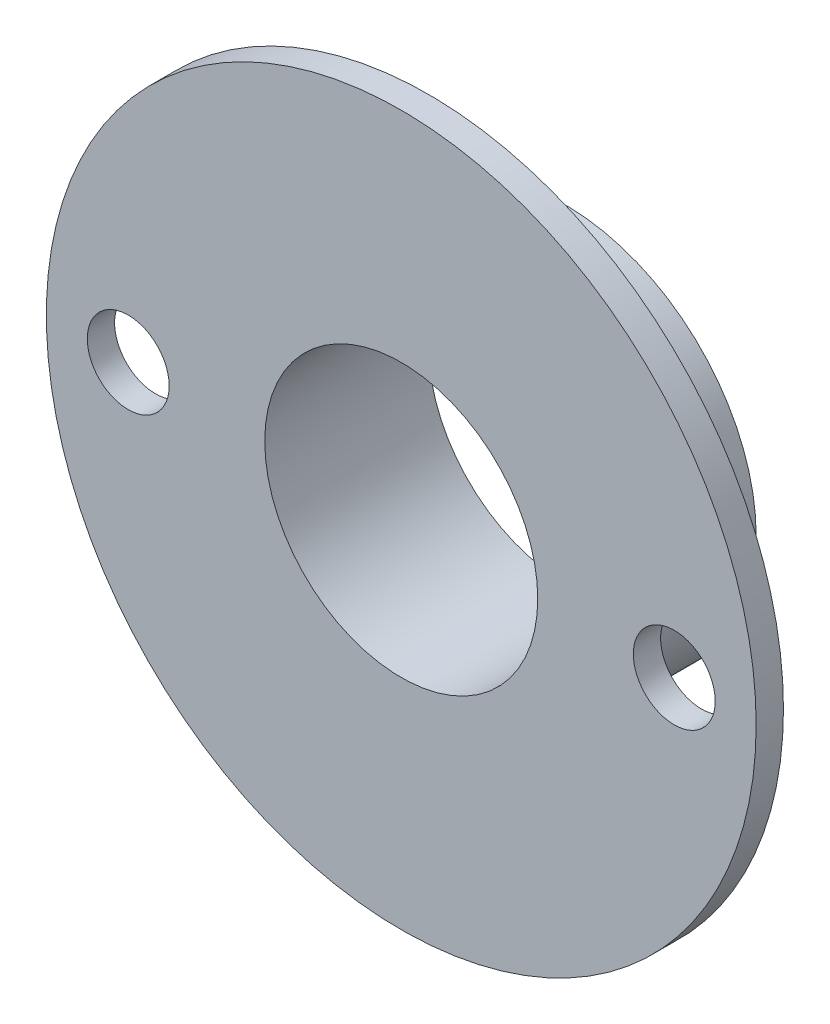
ISO-10303-21;
HEADER;
FILE_DESCRIPTION(('STEP AP214'),'2;1');
FILE_NAME('part.step','',(''),(''),'','','');
FILE_SCHEMA(('AUTOMOTIVE_DESIGN { 1 0 10303 214 1 1 1 1 }'));
ENDSEC;
DATA;
#1=APPLICATION_CONTEXT('core data for automotive mechanical design processes');
#2=APPLICATION_PROTOCOL_DEFINITION('international standard','automotive_design',2000,#1);
#3=PRODUCT_CONTEXT('',#1,'mechanical');
#4=PRODUCT('Part','Part','',(#3));
#5=PRODUCT_RELATED_PRODUCT_CATEGORY('part','',(#4));
#6=PRODUCT_DEFINITION_FORMATION('','',#4);
#7=PRODUCT_DEFINITION_CONTEXT('part definition',#1,'design');
#8=PRODUCT_DEFINITION('design','',#6,#7);
#9=PRODUCT_DEFINITION_SHAPE('','',#8);
#10=(LENGTH_UNIT() NAMED_UNIT(*) SI_UNIT(.MILLI.,.METRE.));
#11=(NAMED_UNIT(*) PLANE_ANGLE_UNIT() SI_UNIT($,.RADIAN.));
#12=(NAMED_UNIT(*) SI_UNIT($,.STERADIAN.) SOLID_ANGLE_UNIT());
#13=UNCERTAINTY_MEASURE_WITH_UNIT(LENGTH_MEASURE(1.E-05),#10,'distance_accuracy_value','');
#14=(GEOMETRIC_REPRESENTATION_CONTEXT(3) GLOBAL_UNCERTAINTY_ASSIGNED_CONTEXT((#13)) GLOBAL_UNIT_ASSIGNED_CONTEXT((#10,
#11,#12)) REPRESENTATION_CONTEXT('',''));
#15=CARTESIAN_POINT('',(0.,0.,0.));
#16=DIRECTION('',(0.,0.,1.));
#17=DIRECTION('',(1.,0.,0.));
#18=AXIS2_PLACEMENT_3D('',#15,#16,#17);
#19=CARTESIAN_POINT('',(0.,0.,6.));
#20=DIRECTION('',(0.,0.,-1.));
#21=DIRECTION('',(-1.,0.,0.));
#22=AXIS2_PLACEMENT_3D('',#19,#20,#21);
#23=CYLINDRICAL_SURFACE('',#22,7.);
#24=CARTESIAN_POINT('',(0.,0.,0.));
#25=DIRECTION('',(0.,0.,1.));
#26=DIRECTION('',(1.,0.,0.));
#27=AXIS2_PLACEMENT_3D('',#24,#25,#26);
#28=CIRCLE('',#27,7.);
#29=CARTESIAN_POINT('',(7.,0.,0.));
#30=VERTEX_POINT('',#29);
#31=EDGE_CURVE('E45',#30,#30,#28,.T.);
#32=ORIENTED_EDGE('',*,*,#31,.T.);
#33=EDGE_LOOP('',(#32));
#34=FACE_BOUND('',#33,.T.);
#35=CARTESIAN_POINT('',(0.,0.,5.));
#36=DIRECTION('',(0.,0.,1.));
#37=DIRECTION('',(1.,0.,0.));
#38=AXIS2_PLACEMENT_3D('',#35,#36,#37);
#39=CIRCLE('',#38,7.);
#40=CARTESIAN_POINT('',(7.,0.,5.));
#41=VERTEX_POINT('',#40);
#42=EDGE_CURVE('E11',#41,#41,#39,.T.);
#43=ORIENTED_EDGE('',*,*,#42,.F.);
#44=EDGE_LOOP('',(#43));
#45=FACE_BOUND('',#44,.T.);
#46=ADVANCED_FACE('F39',(#34,#45),#23,.T.);
#47=CARTESIAN_POINT('',(0.,0.,6.));
#48=DIRECTION('',(0.,0.,1.));
#49=DIRECTION('',(1.,0.,0.));
#50=AXIS2_PLACEMENT_3D('',#47,#48,#49);
#51=PLANE('',#50);
#52=CARTESIAN_POINT('',(-10.,0.,6.));
#53=DIRECTION('',(0.,0.,1.));
#54=DIRECTION('',(1.,0.,0.));
#55=AXIS2_PLACEMENT_3D('',#52,#53,#54);
#56=CIRCLE('',#55,1.5);
#57=CARTESIAN_POINT('',(-8.5,0.,6.));
#58=VERTEX_POINT('',#57);
#59=EDGE_CURVE('E71',#58,#58,#56,.T.);
#60=ORIENTED_EDGE('',*,*,#59,.F.);
#61=EDGE_LOOP('',(#60));
#62=FACE_BOUND('',#61,.T.);
#63=CARTESIAN_POINT('',(10.,0.,6.));
#64=DIRECTION('',(0.,0.,1.));
#65=DIRECTION('',(1.,0.,0.));
#66=AXIS2_PLACEMENT_3D('',#63,#64,#65);
#67=CIRCLE('',#66,1.5);
#68=CARTESIAN_POINT('',(11.5,0.,6.));
#69=VERTEX_POINT('',#68);
#70=EDGE_CURVE('E65',#69,#69,#67,.T.);
#71=ORIENTED_EDGE('',*,*,#70,.F.);
#72=EDGE_LOOP('',(#71));
#73=FACE_BOUND('',#72,.T.);
#74=CARTESIAN_POINT('',(0.,0.,6.));
#75=DIRECTION('',(0.,0.,1.));
#76=DIRECTION('',(1.,0.,0.));
#77=AXIS2_PLACEMENT_3D('',#74,#75,#76);
#78=CIRCLE('',#77,5.);
#79=CARTESIAN_POINT('',(5.,0.,6.));
#80=VERTEX_POINT('',#79);
#81=EDGE_CURVE('E49',#80,#80,#78,.T.);
#82=ORIENTED_EDGE('',*,*,#81,.F.);
#83=EDGE_LOOP('',(#82));
#84=FACE_BOUND('',#83,.T.);
#85=CARTESIAN_POINT('',(0.,0.,6.));
#86=DIRECTION('',(0.,0.,1.));
#87=DIRECTION('',(1.,0.,0.));
#88=AXIS2_PLACEMENT_3D('',#85,#86,#87);
#89=CIRCLE('',#88,13.);
#90=CARTESIAN_POINT('',(13.,0.,6.));
#91=VERTEX_POINT('',#90);
#92=EDGE_CURVE('E59',#91,#91,#89,.T.);
#93=ORIENTED_EDGE('',*,*,#92,.T.);
#94=EDGE_LOOP('',(#93));
#95=FACE_BOUND('',#94,.T.);
#96=ADVANCED_FACE('F87',(#62,#73,#84,#95),#51,.T.);
#97=CARTESIAN_POINT('',(0.,0.,0.));
#98=DIRECTION('',(0.,0.,1.));
#99=DIRECTION('',(1.,0.,0.));
#100=AXIS2_PLACEMENT_3D('',#97,#98,#99);
#101=PLANE('',#100);
#102=ORIENTED_EDGE('',*,*,#31,.F.);
#103=EDGE_LOOP('',(#102));
#104=FACE_BOUND('',#103,.T.);
#105=CARTESIAN_POINT('',(0.,0.,0.));
#106=DIRECTION('',(0.,0.,1.));
#107=DIRECTION('',(1.,0.,0.));
#108=AXIS2_PLACEMENT_3D('',#105,#106,#107);
#109=CIRCLE('',#108,5.);
#110=CARTESIAN_POINT('',(5.,0.,0.));
#111=VERTEX_POINT('',#110);
#112=EDGE_CURVE('E53',#111,#111,#109,.T.);
#113=ORIENTED_EDGE('',*,*,#112,.T.);
#114=EDGE_LOOP('',(#113));
#115=FACE_BOUND('',#114,.T.);
#116=ADVANCED_FACE('F90',(#104,#115),#101,.F.);
#117=CARTESIAN_POINT('',(0.,0.,6.));
#118=DIRECTION('',(0.,0.,-1.));
#119=DIRECTION('',(-1.,0.,0.));
#120=AXIS2_PLACEMENT_3D('',#117,#118,#119);
#121=CYLINDRICAL_SURFACE('',#120,5.);
#122=ORIENTED_EDGE('',*,*,#81,.T.);
#123=EDGE_LOOP('',(#122));
#124=FACE_BOUND('',#123,.T.);
#125=ORIENTED_EDGE('',*,*,#112,.F.);
#126=EDGE_LOOP('',(#125));
#127=FACE_BOUND('',#126,.T.);
#128=ADVANCED_FACE('F100',(#124,#127),#121,.F.);
#129=CARTESIAN_POINT('',(0.,0.,5.));
#130=DIRECTION('',(0.,0.,1.));
#131=DIRECTION('',(1.,0.,0.));
#132=AXIS2_PLACEMENT_3D('',#129,#130,#131);
#133=CYLINDRICAL_SURFACE('',#132,13.);
#134=CARTESIAN_POINT('',(0.,0.,5.));
#135=DIRECTION('',(0.,0.,1.));
#136=DIRECTION('',(1.,0.,0.));
#137=AXIS2_PLACEMENT_3D('',#134,#135,#136);
#138=CIRCLE('',#137,13.);
#139=CARTESIAN_POINT('',(13.,0.,5.));
#140=VERTEX_POINT('',#139);
#141=EDGE_CURVE('E57',#140,#140,#138,.T.);
#142=ORIENTED_EDGE('',*,*,#141,.T.);
#143=EDGE_LOOP('',(#142));
#144=FACE_BOUND('',#143,.T.);
#145=ORIENTED_EDGE('',*,*,#92,.F.);
#146=EDGE_LOOP('',(#145));
#147=FACE_BOUND('',#146,.T.);
#148=ADVANCED_FACE('F98',(#144,#147),#133,.T.);
#149=CARTESIAN_POINT('',(0.,0.,5.));
#150=DIRECTION('',(0.,0.,1.));
#151=DIRECTION('',(1.,0.,0.));
#152=AXIS2_PLACEMENT_3D('',#149,#150,#151);
#153=PLANE('',#152);
#154=CARTESIAN_POINT('',(-10.,0.,5.));
#155=DIRECTION('',(0.,0.,1.));
#156=DIRECTION('',(1.,0.,0.));
#157=AXIS2_PLACEMENT_3D('',#154,#155,#156);
#158=CIRCLE('',#157,1.5);
#159=CARTESIAN_POINT('',(-8.5,0.,5.));
#160=VERTEX_POINT('',#159);
#161=EDGE_CURVE('E62',#160,#160,#158,.T.);
#162=ORIENTED_EDGE('',*,*,#161,.T.);
#163=EDGE_LOOP('',(#162));
#164=FACE_BOUND('',#163,.T.);
#165=CARTESIAN_POINT('',(10.,0.,5.));
#166=DIRECTION('',(0.,0.,1.));
#167=DIRECTION('',(1.,0.,0.));
#168=AXIS2_PLACEMENT_3D('',#165,#166,#167);
#169=CIRCLE('',#168,1.5);
#170=CARTESIAN_POINT('',(11.5,0.,5.));
#171=VERTEX_POINT('',#170);
#172=EDGE_CURVE('E68',#171,#171,#169,.T.);
#173=ORIENTED_EDGE('',*,*,#172,.T.);
#174=EDGE_LOOP('',(#173));
#175=FACE_BOUND('',#174,.T.);
#176=ORIENTED_EDGE('',*,*,#42,.T.);
#177=EDGE_LOOP('',(#176));
#178=FACE_BOUND('',#177,.T.);
#179=ORIENTED_EDGE('',*,*,#141,.F.);
#180=EDGE_LOOP('',(#179));
#181=FACE_BOUND('',#180,.T.);
#182=ADVANCED_FACE('F77',(#164,#175,#178,#181),#153,.F.);
#183=CARTESIAN_POINT('',(10.,0.,5.));
#184=DIRECTION('',(0.,0.,1.));
#185=DIRECTION('',(1.,0.,0.));
#186=AXIS2_PLACEMENT_3D('',#183,#184,#185);
#187=CYLINDRICAL_SURFACE('',#186,1.5);
#188=ORIENTED_EDGE('',*,*,#172,.F.);
#189=EDGE_LOOP('',(#188));
#190=FACE_BOUND('',#189,.T.);
#191=ORIENTED_EDGE('',*,*,#70,.T.);
#192=EDGE_LOOP('',(#191));
#193=FACE_BOUND('',#192,.T.);
#194=ADVANCED_FACE('F83',(#190,#193),#187,.F.);
#195=CARTESIAN_POINT('',(-10.,0.,5.));
#196=DIRECTION('',(0.,0.,1.));
#197=DIRECTION('',(1.,0.,0.));
#198=AXIS2_PLACEMENT_3D('',#195,#196,#197);
#199=CYLINDRICAL_SURFACE('',#198,1.5);
#200=ORIENTED_EDGE('',*,*,#161,.F.);
#201=EDGE_LOOP('',(#200));
#202=FACE_BOUND('',#201,.T.);
#203=ORIENTED_EDGE('',*,*,#59,.T.);
#204=EDGE_LOOP('',(#203));
#205=FACE_BOUND('',#204,.T.);
#206=ADVANCED_FACE('F80',(#202,#205),#199,.F.);
#207=CLOSED_SHELL('',(#46,#96,#116,#128,#148,#182,#194,#206));
#208=MANIFOLD_SOLID_BREP('B2',#207);
#209=ADVANCED_BREP_SHAPE_REPRESENTATION('',(#18,#208),#14);
#210=SHAPE_DEFINITION_REPRESENTATION(#9,#209);
ENDSEC;
END-ISO-10303-21;
